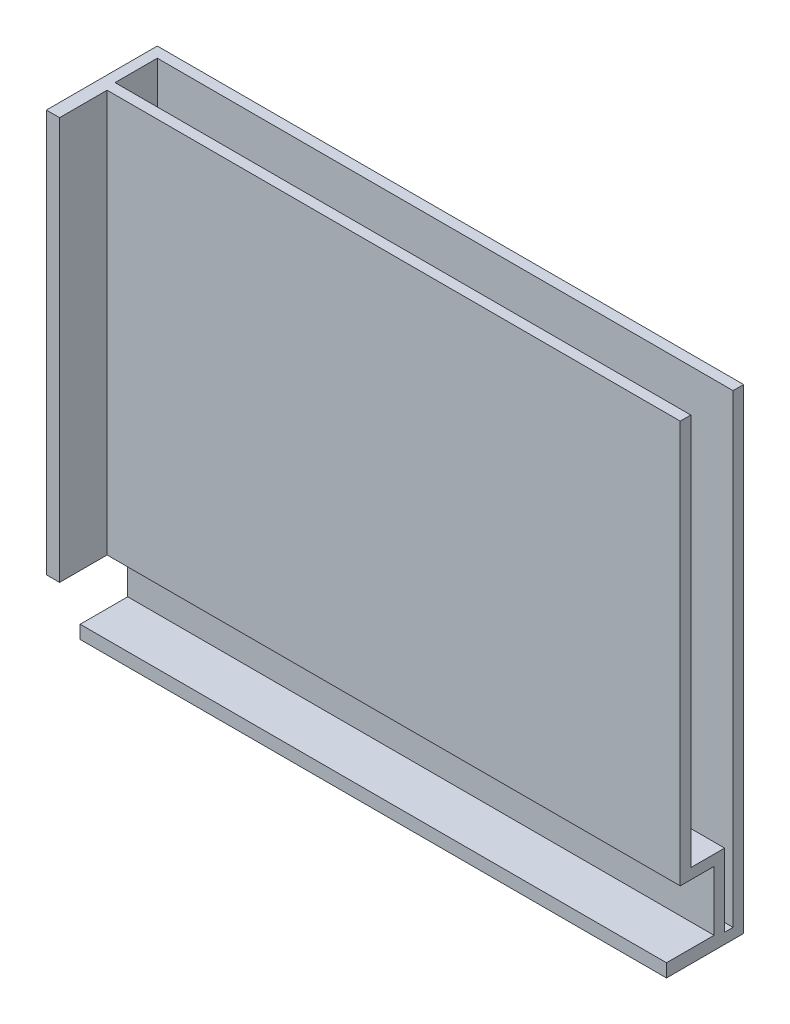
ISO-10303-21;
HEADER;
FILE_DESCRIPTION(('STEP AP214'),'2;1');
FILE_NAME('part.step','',(''),(''),'','','');
FILE_SCHEMA(('AUTOMOTIVE_DESIGN { 1 0 10303 214 1 1 1 1 }'));
ENDSEC;
DATA;
#1=APPLICATION_CONTEXT('core data for automotive mechanical design processes');
#2=APPLICATION_PROTOCOL_DEFINITION('international standard','automotive_design',2000,#1);
#3=PRODUCT_CONTEXT('',#1,'mechanical');
#4=PRODUCT('Part','Part','',(#3));
#5=PRODUCT_RELATED_PRODUCT_CATEGORY('part','',(#4));
#6=PRODUCT_DEFINITION_FORMATION('','',#4);
#7=PRODUCT_DEFINITION_CONTEXT('part definition',#1,'design');
#8=PRODUCT_DEFINITION('design','',#6,#7);
#9=PRODUCT_DEFINITION_SHAPE('','',#8);
#10=(LENGTH_UNIT() NAMED_UNIT(*) SI_UNIT(.MILLI.,.METRE.));
#11=(NAMED_UNIT(*) PLANE_ANGLE_UNIT() SI_UNIT($,.RADIAN.));
#12=(NAMED_UNIT(*) SI_UNIT($,.STERADIAN.) SOLID_ANGLE_UNIT());
#13=UNCERTAINTY_MEASURE_WITH_UNIT(LENGTH_MEASURE(1.E-05),#10,'distance_accuracy_value','');
#14=(GEOMETRIC_REPRESENTATION_CONTEXT(3) GLOBAL_UNCERTAINTY_ASSIGNED_CONTEXT((#13)) GLOBAL_UNIT_ASSIGNED_CONTEXT((#10,
#11,#12)) REPRESENTATION_CONTEXT('',''));
#15=CARTESIAN_POINT('',(0.,0.,0.));
#16=DIRECTION('',(0.,0.,1.));
#17=DIRECTION('',(1.,0.,0.));
#18=AXIS2_PLACEMENT_3D('',#15,#16,#17);
#19=CARTESIAN_POINT('',(72.6068292682926,16.3396341463416,26.68));
#20=DIRECTION('',(0.,-1.,0.));
#21=DIRECTION('',(1.,0.,0.));
#22=AXIS2_PLACEMENT_3D('',#19,#20,#21);
#23=PLANE('',#22);
#24=DIRECTION('',(-1.,0.,0.));
#25=VECTOR('',#24,1.);
#26=CARTESIAN_POINT('',(0.,16.3396341463416,12.7));
#27=LINE('',#26,#25);
#28=CARTESIAN_POINT('',(72.6068292682926,16.3396341463416,12.7));
#29=VERTEX_POINT('',#28);
#30=CARTESIAN_POINT('',(-65.8231707317073,16.3396341463416,12.7));
#31=VERTEX_POINT('',#30);
#32=EDGE_CURVE('E43',#29,#31,#27,.T.);
#33=ORIENTED_EDGE('',*,*,#32,.T.);
#34=DIRECTION('',(0.,0.,1.));
#35=VECTOR('',#34,1.);
#36=CARTESIAN_POINT('',(-65.8231707317073,16.3396341463416,17.272));
#37=LINE('',#36,#35);
#38=CARTESIAN_POINT('',(-65.8231707317073,16.3396341463416,2.54));
#39=VERTEX_POINT('',#38);
#40=EDGE_CURVE('E227',#39,#31,#37,.T.);
#41=ORIENTED_EDGE('',*,*,#40,.F.);
#42=DIRECTION('',(1.,0.,0.));
#43=VECTOR('',#42,1.);
#44=CARTESIAN_POINT('',(0.,16.3396341463416,2.54));
#45=LINE('',#44,#43);
#46=CARTESIAN_POINT('',(72.6068292682926,16.3396341463416,2.54));
#47=VERTEX_POINT('',#46);
#48=EDGE_CURVE('E228',#39,#47,#45,.T.);
#49=ORIENTED_EDGE('',*,*,#48,.T.);
#50=DIRECTION('',(0.,0.,-1.));
#51=VECTOR('',#50,1.);
#52=CARTESIAN_POINT('',(72.6068292682926,16.3396341463416,26.68));
#53=LINE('',#52,#51);
#54=CARTESIAN_POINT('',(72.6068292682926,16.3396341463416,0.));
#55=VERTEX_POINT('',#54);
#56=EDGE_CURVE('E223',#47,#55,#53,.T.);
#57=ORIENTED_EDGE('',*,*,#56,.T.);
#58=DIRECTION('',(1.,0.,0.));
#59=VECTOR('',#58,1.);
#60=CARTESIAN_POINT('',(0.,16.3396341463416,0.));
#61=LINE('',#60,#59);
#62=CARTESIAN_POINT('',(-68.3631707317074,16.3396341463416,0.));
#63=VERTEX_POINT('',#62);
#64=EDGE_CURVE('E219',#63,#55,#61,.T.);
#65=ORIENTED_EDGE('',*,*,#64,.F.);
#66=DIRECTION('',(0.,0.,1.));
#67=VECTOR('',#66,1.);
#68=CARTESIAN_POINT('',(-68.3631707317073,16.3396341463416,17.272));
#69=LINE('',#68,#67);
#70=CARTESIAN_POINT('',(-68.3631707317074,16.3396341463416,26.67));
#71=VERTEX_POINT('',#70);
#72=EDGE_CURVE('E48',#63,#71,#69,.T.);
#73=ORIENTED_EDGE('',*,*,#72,.T.);
#74=DIRECTION('',(1.,0.,0.));
#75=VECTOR('',#74,1.);
#76=CARTESIAN_POINT('',(0.,16.3396341463416,26.67));
#77=LINE('',#76,#75);
#78=CARTESIAN_POINT('',(-65.1881707317074,16.3396341463416,26.67));
#79=VERTEX_POINT('',#78);
#80=EDGE_CURVE('E11',#71,#79,#77,.T.);
#81=ORIENTED_EDGE('',*,*,#80,.T.);
#82=DIRECTION('',(0.,0.,-1.));
#83=VECTOR('',#82,1.);
#84=CARTESIAN_POINT('',(-65.1881707317074,16.3396341463416,0.));
#85=LINE('',#84,#83);
#86=CARTESIAN_POINT('',(-65.1881707317074,16.3396341463416,15.24));
#87=VERTEX_POINT('',#86);
#88=EDGE_CURVE('E62',#79,#87,#85,.T.);
#89=ORIENTED_EDGE('',*,*,#88,.T.);
#90=DIRECTION('',(-1.,0.,0.));
#91=VECTOR('',#90,1.);
#92=CARTESIAN_POINT('',(0.,16.3396341463416,15.24));
#93=LINE('',#92,#91);
#94=CARTESIAN_POINT('',(72.6068292682926,16.3396341463416,15.24));
#95=VERTEX_POINT('',#94);
#96=EDGE_CURVE('E221',#95,#87,#93,.T.);
#97=ORIENTED_EDGE('',*,*,#96,.F.);
#98=EDGE_CURVE('E162',#95,#29,#53,.T.);
#99=ORIENTED_EDGE('',*,*,#98,.T.);
#100=EDGE_LOOP('',(#33,#41,#49,#57,#65,#73,#81,#89,#97,#99));
#101=FACE_BOUND('',#100,.T.);
#102=ADVANCED_FACE('F40',(#101),#23,.F.);
#103=CARTESIAN_POINT('',(0.,0.,4.572));
#104=DIRECTION('',(0.,0.,-1.));
#105=DIRECTION('',(-1.,0.,0.));
#106=AXIS2_PLACEMENT_3D('',#103,#104,#105);
#107=PLANE('',#106);
#108=DIRECTION('',(-1.,0.,0.));
#109=VECTOR('',#108,1.);
#110=CARTESIAN_POINT('',(-68.3631707317074,-77.8943658536585,4.572));
#111=LINE('',#110,#109);
#112=CARTESIAN_POINT('',(72.6068292682926,-77.8943658536585,4.572));
#113=VERTEX_POINT('',#112);
#114=CARTESIAN_POINT('',(-65.8231707317073,-77.8943658536585,4.572));
#115=VERTEX_POINT('',#114);
#116=EDGE_CURVE('E194',#113,#115,#111,.T.);
#117=ORIENTED_EDGE('',*,*,#116,.F.);
#118=DIRECTION('',(0.,-1.,0.));
#119=VECTOR('',#118,1.);
#120=CARTESIAN_POINT('',(72.6068292682926,0.,4.572));
#121=LINE('',#120,#119);
#122=CARTESIAN_POINT('',(72.6068292682926,-95.4203658536585,4.572));
#123=VERTEX_POINT('',#122);
#124=EDGE_CURVE('E245',#113,#123,#121,.T.);
#125=ORIENTED_EDGE('',*,*,#124,.T.);
#126=DIRECTION('',(-1.,0.,0.));
#127=VECTOR('',#126,1.);
#128=CARTESIAN_POINT('',(0.,-95.4203658536585,4.572));
#129=LINE('',#128,#127);
#130=CARTESIAN_POINT('',(-65.8231707317073,-95.4203658536585,4.572));
#131=VERTEX_POINT('',#130);
#132=EDGE_CURVE('E200',#123,#131,#129,.T.);
#133=ORIENTED_EDGE('',*,*,#132,.T.);
#134=DIRECTION('',(0.,-1.,0.));
#135=VECTOR('',#134,1.);
#136=CARTESIAN_POINT('',(-65.8231707317073,-94.7853658536585,4.572));
#137=LINE('',#136,#135);
#138=EDGE_CURVE('E192',#115,#131,#137,.T.);
#139=ORIENTED_EDGE('',*,*,#138,.F.);
#140=EDGE_LOOP('',(#117,#125,#133,#139));
#141=FACE_BOUND('',#140,.T.);
#142=ADVANCED_FACE('F307',(#141),#107,.T.);
#143=CARTESIAN_POINT('',(-68.3631707317074,-77.8943658536585,17.272));
#144=DIRECTION('',(0.,1.,0.));
#145=DIRECTION('',(0.,0.,1.));
#146=AXIS2_PLACEMENT_3D('',#143,#144,#145);
#147=PLANE('',#146);
#148=DIRECTION('',(1.,0.,0.));
#149=VECTOR('',#148,1.);
#150=CARTESIAN_POINT('',(0.,-77.8943658536585,12.7));
#151=LINE('',#150,#149);
#152=CARTESIAN_POINT('',(-65.8231707317073,-77.8943658536585,12.7));
#153=VERTEX_POINT('',#152);
#154=CARTESIAN_POINT('',(72.6068292682926,-77.8943658536585,12.7));
#155=VERTEX_POINT('',#154);
#156=EDGE_CURVE('E189',#153,#155,#151,.T.);
#157=ORIENTED_EDGE('',*,*,#156,.T.);
#158=DIRECTION('',(0.,0.,-1.));
#159=VECTOR('',#158,1.);
#160=CARTESIAN_POINT('',(72.6068292682926,-77.8943658536585,17.272));
#161=LINE('',#160,#159);
#162=EDGE_CURVE('E244',#155,#113,#161,.T.);
#163=ORIENTED_EDGE('',*,*,#162,.T.);
#164=ORIENTED_EDGE('',*,*,#116,.T.);
#165=DIRECTION('',(0.,0.,1.));
#166=VECTOR('',#165,1.);
#167=CARTESIAN_POINT('',(-65.8231707317073,-77.8943658536585,17.272));
#168=LINE('',#167,#166);
#169=EDGE_CURVE('E289',#115,#153,#168,.T.);
#170=ORIENTED_EDGE('',*,*,#169,.T.);
#171=EDGE_LOOP('',(#157,#163,#164,#170));
#172=FACE_BOUND('',#171,.T.);
#173=ADVANCED_FACE('F301',(#172),#147,.T.);
#174=CARTESIAN_POINT('',(0.,0.,7.112));
#175=DIRECTION('',(0.,0.,-1.));
#176=DIRECTION('',(-1.,0.,0.));
#177=AXIS2_PLACEMENT_3D('',#174,#175,#176);
#178=PLANE('',#177);
#179=DIRECTION('',(0.,-1.,0.));
#180=VECTOR('',#179,1.);
#181=CARTESIAN_POINT('',(72.6068292682926,0.,7.112));
#182=LINE('',#181,#180);
#183=CARTESIAN_POINT('',(72.6068292682926,-80.4343658536585,7.112));
#184=VERTEX_POINT('',#183);
#185=CARTESIAN_POINT('',(72.6068292682926,-94.7853658536585,7.112));
#186=VERTEX_POINT('',#185);
#187=EDGE_CURVE('E165',#184,#186,#182,.T.);
#188=ORIENTED_EDGE('',*,*,#187,.F.);
#189=DIRECTION('',(-1.,0.,0.));
#190=VECTOR('',#189,1.);
#191=CARTESIAN_POINT('',(-68.3631707317074,-80.4343658536585,7.112));
#192=LINE('',#191,#190);
#193=CARTESIAN_POINT('',(-68.3631707317074,-80.4343658536585,7.112));
#194=VERTEX_POINT('',#193);
#195=EDGE_CURVE('E174',#184,#194,#192,.T.);
#196=ORIENTED_EDGE('',*,*,#195,.T.);
#197=DIRECTION('',(0.,-1.,0.));
#198=VECTOR('',#197,1.);
#199=CARTESIAN_POINT('',(-68.3631707317073,-94.7853658536585,7.112));
#200=LINE('',#199,#198);
#201=CARTESIAN_POINT('',(-68.3631707317073,-94.7853658536585,7.112));
#202=VERTEX_POINT('',#201);
#203=EDGE_CURVE('E209',#194,#202,#200,.T.);
#204=ORIENTED_EDGE('',*,*,#203,.T.);
#205=DIRECTION('',(1.,0.,0.));
#206=VECTOR('',#205,1.);
#207=CARTESIAN_POINT('',(213.576829268293,-94.7853658536585,7.112));
#208=LINE('',#207,#206);
#209=EDGE_CURVE('E207',#202,#186,#208,.T.);
#210=ORIENTED_EDGE('',*,*,#209,.T.);
#211=EDGE_LOOP('',(#188,#196,#204,#210));
#212=FACE_BOUND('',#211,.T.);
#213=ADVANCED_FACE('F268',(#212),#178,.F.);
#214=CARTESIAN_POINT('',(0.,-94.7853658536585,0.));
#215=DIRECTION('',(0.,1.,0.));
#216=DIRECTION('',(0.,0.,1.));
#217=AXIS2_PLACEMENT_3D('',#214,#215,#216);
#218=PLANE('',#217);
#219=DIRECTION('',(-1.,0.,0.));
#220=VECTOR('',#219,1.);
#221=CARTESIAN_POINT('',(213.576829268293,-94.7853658536585,18.542));
#222=LINE('',#221,#220);
#223=CARTESIAN_POINT('',(72.6068292682926,-94.7853658536585,18.542));
#224=VERTEX_POINT('',#223);
#225=CARTESIAN_POINT('',(-68.3631707317073,-94.7853658536585,18.542));
#226=VERTEX_POINT('',#225);
#227=EDGE_CURVE('E217',#224,#226,#222,.T.);
#228=ORIENTED_EDGE('',*,*,#227,.F.);
#229=DIRECTION('',(0.,0.,-1.));
#230=VECTOR('',#229,1.);
#231=CARTESIAN_POINT('',(72.6068292682926,-94.7853658536585,0.));
#232=LINE('',#231,#230);
#233=EDGE_CURVE('E182',#224,#186,#232,.T.);
#234=ORIENTED_EDGE('',*,*,#233,.T.);
#235=ORIENTED_EDGE('',*,*,#209,.F.);
#236=DIRECTION('',(0.,0.,-1.));
#237=VECTOR('',#236,1.);
#238=CARTESIAN_POINT('',(-68.3631707317073,-94.7853658536585,17.272));
#239=LINE('',#238,#237);
#240=EDGE_CURVE('E287',#226,#202,#239,.T.);
#241=ORIENTED_EDGE('',*,*,#240,.F.);
#242=EDGE_LOOP('',(#228,#234,#235,#241));
#243=FACE_BOUND('',#242,.T.);
#244=ADVANCED_FACE('F264',(#243),#218,.T.);
#245=CARTESIAN_POINT('',(0.,0.,18.542));
#246=DIRECTION('',(0.,0.,1.));
#247=DIRECTION('',(1.,0.,0.));
#248=AXIS2_PLACEMENT_3D('',#245,#246,#247);
#249=PLANE('',#248);
#250=DIRECTION('',(1.,0.,0.));
#251=VECTOR('',#250,1.);
#252=CARTESIAN_POINT('',(-68.3631707317073,-97.9603658536585,18.542));
#253=LINE('',#252,#251);
#254=CARTESIAN_POINT('',(-68.3631707317073,-97.9603658536585,18.542));
#255=VERTEX_POINT('',#254);
#256=CARTESIAN_POINT('',(72.6068292682926,-97.9603658536585,18.542));
#257=VERTEX_POINT('',#256);
#258=EDGE_CURVE('E212',#255,#257,#253,.T.);
#259=ORIENTED_EDGE('',*,*,#258,.T.);
#260=DIRECTION('',(0.,1.,0.));
#261=VECTOR('',#260,1.);
#262=CARTESIAN_POINT('',(72.6068292682926,0.,18.542));
#263=LINE('',#262,#261);
#264=EDGE_CURVE('E258',#257,#224,#263,.T.);
#265=ORIENTED_EDGE('',*,*,#264,.T.);
#266=ORIENTED_EDGE('',*,*,#227,.T.);
#267=DIRECTION('',(0.,-1.,0.));
#268=VECTOR('',#267,1.);
#269=CARTESIAN_POINT('',(-68.3631707317073,-94.7853658536585,18.542));
#270=LINE('',#269,#268);
#271=EDGE_CURVE('E215',#226,#255,#270,.T.);
#272=ORIENTED_EDGE('',*,*,#271,.T.);
#273=EDGE_LOOP('',(#259,#265,#266,#272));
#274=FACE_BOUND('',#273,.T.);
#275=ADVANCED_FACE('F328',(#274),#249,.T.);
#276=CARTESIAN_POINT('',(-68.3631707317074,-80.4343658536585,17.272));
#277=DIRECTION('',(0.,1.,0.));
#278=DIRECTION('',(0.,0.,1.));
#279=AXIS2_PLACEMENT_3D('',#276,#277,#278);
#280=PLANE('',#279);
#281=DIRECTION('',(0.,0.,-1.));
#282=VECTOR('',#281,1.);
#283=CARTESIAN_POINT('',(72.6068292682926,-80.4343658536585,17.272));
#284=LINE('',#283,#282);
#285=CARTESIAN_POINT('',(72.6068292682926,-80.4343658536585,15.24));
#286=VERTEX_POINT('',#285);
#287=EDGE_CURVE('E159',#286,#184,#284,.T.);
#288=ORIENTED_EDGE('',*,*,#287,.F.);
#289=DIRECTION('',(1.,0.,0.));
#290=VECTOR('',#289,1.);
#291=CARTESIAN_POINT('',(210.401829268293,-80.4343658536585,15.24));
#292=LINE('',#291,#290);
#293=CARTESIAN_POINT('',(-65.1881707317073,-80.4343658536585,15.24));
#294=VERTEX_POINT('',#293);
#295=EDGE_CURVE('E168',#294,#286,#292,.T.);
#296=ORIENTED_EDGE('',*,*,#295,.F.);
#297=DIRECTION('',(0.,0.,1.));
#298=VECTOR('',#297,1.);
#299=CARTESIAN_POINT('',(-65.1881707317073,-80.4343658536585,36.83));
#300=LINE('',#299,#298);
#301=CARTESIAN_POINT('',(-65.1881707317073,-80.4343658536585,26.67));
#302=VERTEX_POINT('',#301);
#303=EDGE_CURVE('E210',#294,#302,#300,.T.);
#304=ORIENTED_EDGE('',*,*,#303,.T.);
#305=DIRECTION('',(1.,0.,0.));
#306=VECTOR('',#305,1.);
#307=CARTESIAN_POINT('',(-68.3631707317073,-80.4343658536585,26.67));
#308=LINE('',#307,#306);
#309=CARTESIAN_POINT('',(-68.3631707317073,-80.4343658536585,26.67));
#310=VERTEX_POINT('',#309);
#311=EDGE_CURVE('E279',#310,#302,#308,.T.);
#312=ORIENTED_EDGE('',*,*,#311,.F.);
#313=DIRECTION('',(0.,0.,1.));
#314=VECTOR('',#313,1.);
#315=CARTESIAN_POINT('',(-68.3631707317074,-80.4343658536585,17.272));
#316=LINE('',#315,#314);
#317=EDGE_CURVE('E283',#194,#310,#316,.T.);
#318=ORIENTED_EDGE('',*,*,#317,.F.);
#319=ORIENTED_EDGE('',*,*,#195,.F.);
#320=EDGE_LOOP('',(#288,#296,#304,#312,#318,#319));
#321=FACE_BOUND('',#320,.T.);
#322=ADVANCED_FACE('F176',(#321),#280,.F.);
#323=CARTESIAN_POINT('',(-65.1881707317074,0.,0.));
#324=DIRECTION('',(1.,0.,0.));
#325=DIRECTION('',(0.,1.,0.));
#326=AXIS2_PLACEMENT_3D('',#323,#324,#325);
#327=PLANE('',#326);
#328=ORIENTED_EDGE('',*,*,#88,.F.);
#329=DIRECTION('',(0.,1.,0.));
#330=VECTOR('',#329,1.);
#331=CARTESIAN_POINT('',(-65.1881707317073,-80.4343658536585,26.67));
#332=LINE('',#331,#330);
#333=EDGE_CURVE('E277',#302,#79,#332,.T.);
#334=ORIENTED_EDGE('',*,*,#333,.F.);
#335=ORIENTED_EDGE('',*,*,#303,.F.);
#336=DIRECTION('',(0.,-1.,0.));
#337=VECTOR('',#336,1.);
#338=CARTESIAN_POINT('',(-65.1881707317073,-80.4343658536585,15.24));
#339=LINE('',#338,#337);
#340=EDGE_CURVE('E170',#87,#294,#339,.T.);
#341=ORIENTED_EDGE('',*,*,#340,.F.);
#342=EDGE_LOOP('',(#328,#334,#335,#341));
#343=FACE_BOUND('',#342,.T.);
#344=ADVANCED_FACE('F334',(#343),#327,.T.);
#345=CARTESIAN_POINT('',(0.,-97.9603658536585,0.));
#346=DIRECTION('',(0.,1.,0.));
#347=DIRECTION('',(0.,0.,1.));
#348=AXIS2_PLACEMENT_3D('',#345,#346,#347);
#349=PLANE('',#348);
#350=DIRECTION('',(0.,0.,-1.));
#351=VECTOR('',#350,1.);
#352=CARTESIAN_POINT('',(72.6068292682926,-97.9603658536585,0.));
#353=LINE('',#352,#351);
#354=CARTESIAN_POINT('',(72.6068292682926,-97.9603658536585,0.));
#355=VERTEX_POINT('',#354);
#356=EDGE_CURVE('E178',#257,#355,#353,.T.);
#357=ORIENTED_EDGE('',*,*,#356,.F.);
#358=ORIENTED_EDGE('',*,*,#258,.F.);
#359=DIRECTION('',(0.,0.,-1.));
#360=VECTOR('',#359,1.);
#361=CARTESIAN_POINT('',(-68.3631707317073,-97.9603658536585,17.272));
#362=LINE('',#361,#360);
#363=CARTESIAN_POINT('',(-68.3631707317073,-97.9603658536585,0.));
#364=VERTEX_POINT('',#363);
#365=EDGE_CURVE('E206',#255,#364,#362,.T.);
#366=ORIENTED_EDGE('',*,*,#365,.T.);
#367=DIRECTION('',(1.,0.,0.));
#368=VECTOR('',#367,1.);
#369=CARTESIAN_POINT('',(-68.3631707317073,-97.9603658536585,0.));
#370=LINE('',#369,#368);
#371=EDGE_CURVE('E203',#364,#355,#370,.T.);
#372=ORIENTED_EDGE('',*,*,#371,.T.);
#373=EDGE_LOOP('',(#357,#358,#366,#372));
#374=FACE_BOUND('',#373,.T.);
#375=ADVANCED_FACE('F326',(#374),#349,.F.);
#376=CARTESIAN_POINT('',(72.6068292682926,130.639634146342,26.68));
#377=DIRECTION('',(1.,0.,0.));
#378=DIRECTION('',(0.,1.,0.));
#379=AXIS2_PLACEMENT_3D('',#376,#377,#378);
#380=PLANE('',#379);
#381=ORIENTED_EDGE('',*,*,#98,.F.);
#382=DIRECTION('',(0.,-1.,0.));
#383=VECTOR('',#382,1.);
#384=CARTESIAN_POINT('',(72.6068292682926,0.,15.24));
#385=LINE('',#384,#383);
#386=EDGE_CURVE('E154',#95,#286,#385,.T.);
#387=ORIENTED_EDGE('',*,*,#386,.T.);
#388=ORIENTED_EDGE('',*,*,#287,.T.);
#389=ORIENTED_EDGE('',*,*,#187,.T.);
#390=ORIENTED_EDGE('',*,*,#233,.F.);
#391=ORIENTED_EDGE('',*,*,#264,.F.);
#392=ORIENTED_EDGE('',*,*,#356,.T.);
#393=DIRECTION('',(0.,1.,0.));
#394=VECTOR('',#393,1.);
#395=CARTESIAN_POINT('',(72.6068292682926,0.,0.));
#396=LINE('',#395,#394);
#397=EDGE_CURVE('E179',#355,#55,#396,.T.);
#398=ORIENTED_EDGE('',*,*,#397,.T.);
#399=ORIENTED_EDGE('',*,*,#56,.F.);
#400=DIRECTION('',(0.,1.,0.));
#401=VECTOR('',#400,1.);
#402=CARTESIAN_POINT('',(72.6068292682926,0.,2.54));
#403=LINE('',#402,#401);
#404=CARTESIAN_POINT('',(72.6068292682926,-95.4203658536585,2.54));
#405=VERTEX_POINT('',#404);
#406=EDGE_CURVE('E247',#405,#47,#403,.T.);
#407=ORIENTED_EDGE('',*,*,#406,.F.);
#408=DIRECTION('',(0.,0.,-1.));
#409=VECTOR('',#408,1.);
#410=CARTESIAN_POINT('',(72.6068292682926,-95.4203658536585,0.));
#411=LINE('',#410,#409);
#412=EDGE_CURVE('E255',#123,#405,#411,.T.);
#413=ORIENTED_EDGE('',*,*,#412,.F.);
#414=ORIENTED_EDGE('',*,*,#124,.F.);
#415=ORIENTED_EDGE('',*,*,#162,.F.);
#416=DIRECTION('',(0.,-1.,0.));
#417=VECTOR('',#416,1.);
#418=CARTESIAN_POINT('',(72.6068292682926,0.,12.7));
#419=LINE('',#418,#417);
#420=EDGE_CURVE('E193',#29,#155,#419,.T.);
#421=ORIENTED_EDGE('',*,*,#420,.F.);
#422=EDGE_LOOP('',(#381,#387,#388,#389,#390,#391,#392,#398,#399,#407,#413,#414,#415,#421));
#423=FACE_BOUND('',#422,.T.);
#424=ADVANCED_FACE('F156',(#423),#380,.T.);
#425=CARTESIAN_POINT('',(-68.3631707317073,-94.7853658536585,17.272));
#426=DIRECTION('',(-1.,0.,0.));
#427=DIRECTION('',(0.,0.,1.));
#428=AXIS2_PLACEMENT_3D('',#425,#426,#427);
#429=PLANE('',#428);
#430=ORIENTED_EDGE('',*,*,#72,.F.);
#431=DIRECTION('',(0.,-1.,0.));
#432=VECTOR('',#431,1.);
#433=CARTESIAN_POINT('',(-68.3631707317074,130.639634146342,0.));
#434=LINE('',#433,#432);
#435=EDGE_CURVE('E205',#63,#364,#434,.T.);
#436=ORIENTED_EDGE('',*,*,#435,.T.);
#437=ORIENTED_EDGE('',*,*,#365,.F.);
#438=ORIENTED_EDGE('',*,*,#271,.F.);
#439=ORIENTED_EDGE('',*,*,#240,.T.);
#440=ORIENTED_EDGE('',*,*,#203,.F.);
#441=ORIENTED_EDGE('',*,*,#317,.T.);
#442=DIRECTION('',(0.,-1.,0.));
#443=VECTOR('',#442,1.);
#444=CARTESIAN_POINT('',(-68.3631707317074,130.639634146342,26.67));
#445=LINE('',#444,#443);
#446=EDGE_CURVE('E216',#71,#310,#445,.T.);
#447=ORIENTED_EDGE('',*,*,#446,.F.);
#448=EDGE_LOOP('',(#430,#436,#437,#438,#439,#440,#441,#447));
#449=FACE_BOUND('',#448,.T.);
#450=ADVANCED_FACE('F284',(#449),#429,.T.);
#451=CARTESIAN_POINT('',(0.,0.,0.));
#452=DIRECTION('',(0.,0.,1.));
#453=DIRECTION('',(1.,0.,0.));
#454=AXIS2_PLACEMENT_3D('',#451,#452,#453);
#455=PLANE('',#454);
#456=ORIENTED_EDGE('',*,*,#435,.F.);
#457=ORIENTED_EDGE('',*,*,#64,.T.);
#458=ORIENTED_EDGE('',*,*,#397,.F.);
#459=ORIENTED_EDGE('',*,*,#371,.F.);
#460=EDGE_LOOP('',(#456,#457,#458,#459));
#461=FACE_BOUND('',#460,.T.);
#462=ADVANCED_FACE('F321',(#461),#455,.F.);
#463=CARTESIAN_POINT('',(0.,0.,15.24));
#464=DIRECTION('',(0.,0.,-1.));
#465=DIRECTION('',(-1.,0.,0.));
#466=AXIS2_PLACEMENT_3D('',#463,#464,#465);
#467=PLANE('',#466);
#468=ORIENTED_EDGE('',*,*,#386,.F.);
#469=ORIENTED_EDGE('',*,*,#96,.T.);
#470=ORIENTED_EDGE('',*,*,#340,.T.);
#471=ORIENTED_EDGE('',*,*,#295,.T.);
#472=EDGE_LOOP('',(#468,#469,#470,#471));
#473=FACE_BOUND('',#472,.T.);
#474=ADVANCED_FACE('F169',(#473),#467,.F.);
#475=CARTESIAN_POINT('',(0.,0.,26.67));
#476=DIRECTION('',(0.,0.,1.));
#477=DIRECTION('',(1.,0.,0.));
#478=AXIS2_PLACEMENT_3D('',#475,#476,#477);
#479=PLANE('',#478);
#480=ORIENTED_EDGE('',*,*,#80,.F.);
#481=ORIENTED_EDGE('',*,*,#446,.T.);
#482=ORIENTED_EDGE('',*,*,#311,.T.);
#483=ORIENTED_EDGE('',*,*,#333,.T.);
#484=EDGE_LOOP('',(#480,#481,#482,#483));
#485=FACE_BOUND('',#484,.T.);
#486=ADVANCED_FACE('F282',(#485),#479,.T.);
#487=CARTESIAN_POINT('',(0.,-95.4203658536585,0.));
#488=DIRECTION('',(0.,1.,0.));
#489=DIRECTION('',(0.,0.,1.));
#490=AXIS2_PLACEMENT_3D('',#487,#488,#489);
#491=PLANE('',#490);
#492=ORIENTED_EDGE('',*,*,#132,.F.);
#493=ORIENTED_EDGE('',*,*,#412,.T.);
#494=DIRECTION('',(1.,0.,0.));
#495=VECTOR('',#494,1.);
#496=CARTESIAN_POINT('',(0.,-95.4203658536585,2.54));
#497=LINE('',#496,#495);
#498=CARTESIAN_POINT('',(-65.8231707317073,-95.4203658536585,2.54));
#499=VERTEX_POINT('',#498);
#500=EDGE_CURVE('E196',#499,#405,#497,.T.);
#501=ORIENTED_EDGE('',*,*,#500,.F.);
#502=DIRECTION('',(0.,0.,-1.));
#503=VECTOR('',#502,1.);
#504=CARTESIAN_POINT('',(-65.8231707317073,-95.4203658536585,17.272));
#505=LINE('',#504,#503);
#506=EDGE_CURVE('E199',#131,#499,#505,.T.);
#507=ORIENTED_EDGE('',*,*,#506,.F.);
#508=EDGE_LOOP('',(#492,#493,#501,#507));
#509=FACE_BOUND('',#508,.T.);
#510=ADVANCED_FACE('F311',(#509),#491,.T.);
#511=CARTESIAN_POINT('',(-65.8231707317073,-94.7853658536585,17.272));
#512=DIRECTION('',(-1.,0.,0.));
#513=DIRECTION('',(0.,0.,1.));
#514=AXIS2_PLACEMENT_3D('',#511,#512,#513);
#515=PLANE('',#514);
#516=DIRECTION('',(0.,-1.,0.));
#517=VECTOR('',#516,1.);
#518=CARTESIAN_POINT('',(-65.8231707317073,0.,2.54));
#519=LINE('',#518,#517);
#520=EDGE_CURVE('E202',#39,#499,#519,.T.);
#521=ORIENTED_EDGE('',*,*,#520,.F.);
#522=ORIENTED_EDGE('',*,*,#40,.T.);
#523=DIRECTION('',(0.,1.,0.));
#524=VECTOR('',#523,1.);
#525=CARTESIAN_POINT('',(-65.8231707317073,0.,12.7));
#526=LINE('',#525,#524);
#527=EDGE_CURVE('E242',#153,#31,#526,.T.);
#528=ORIENTED_EDGE('',*,*,#527,.F.);
#529=ORIENTED_EDGE('',*,*,#169,.F.);
#530=ORIENTED_EDGE('',*,*,#138,.T.);
#531=ORIENTED_EDGE('',*,*,#506,.T.);
#532=EDGE_LOOP('',(#521,#522,#528,#529,#530,#531));
#533=FACE_BOUND('',#532,.T.);
#534=ADVANCED_FACE('F304',(#533),#515,.F.);
#535=CARTESIAN_POINT('',(0.,0.,2.54));
#536=DIRECTION('',(0.,0.,1.));
#537=DIRECTION('',(1.,0.,0.));
#538=AXIS2_PLACEMENT_3D('',#535,#536,#537);
#539=PLANE('',#538);
#540=ORIENTED_EDGE('',*,*,#48,.F.);
#541=ORIENTED_EDGE('',*,*,#520,.T.);
#542=ORIENTED_EDGE('',*,*,#500,.T.);
#543=ORIENTED_EDGE('',*,*,#406,.T.);
#544=EDGE_LOOP('',(#540,#541,#542,#543));
#545=FACE_BOUND('',#544,.T.);
#546=ADVANCED_FACE('F314',(#545),#539,.T.);
#547=CARTESIAN_POINT('',(0.,0.,12.7));
#548=DIRECTION('',(0.,0.,-1.));
#549=DIRECTION('',(-1.,0.,0.));
#550=AXIS2_PLACEMENT_3D('',#547,#548,#549);
#551=PLANE('',#550);
#552=ORIENTED_EDGE('',*,*,#32,.F.);
#553=ORIENTED_EDGE('',*,*,#420,.T.);
#554=ORIENTED_EDGE('',*,*,#156,.F.);
#555=ORIENTED_EDGE('',*,*,#527,.T.);
#556=EDGE_LOOP('',(#552,#553,#554,#555));
#557=FACE_BOUND('',#556,.T.);
#558=ADVANCED_FACE('F239',(#557),#551,.T.);
#559=CLOSED_SHELL('',(#102,#142,#173,#213,#244,#275,#322,#344,#375,#424,#450,#462,#474,#486,
#510,#534,#546,#558));
#560=MANIFOLD_SOLID_BREP('B2',#559);
#561=ADVANCED_BREP_SHAPE_REPRESENTATION('',(#18,#560),#14);
#562=SHAPE_DEFINITION_REPRESENTATION(#9,#561);
ENDSEC;
END-ISO-10303-21;
